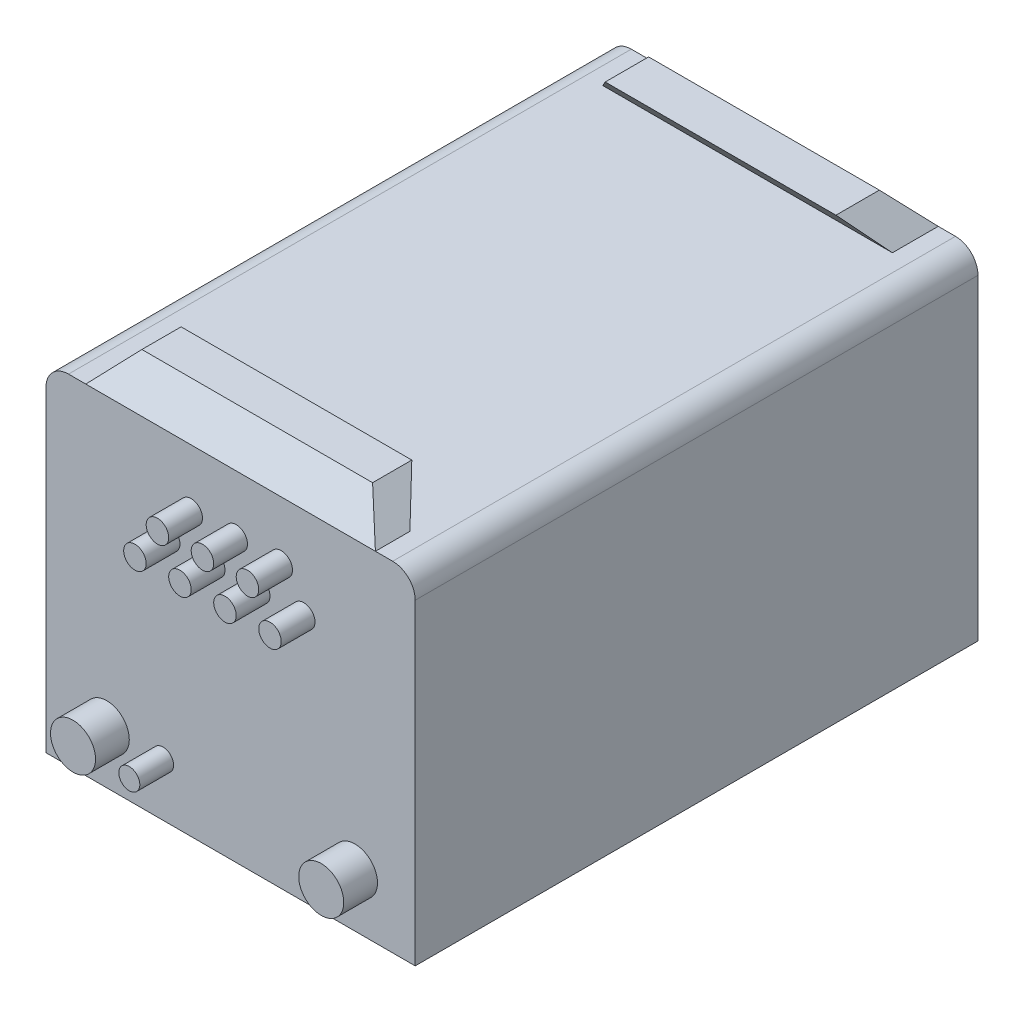
ISO-10303-21;
HEADER;
FILE_DESCRIPTION(('STEP AP214'),'2;1');
FILE_NAME('part.step','',(''),(''),'','','');
FILE_SCHEMA(('AUTOMOTIVE_DESIGN { 1 0 10303 214 1 1 1 1 }'));
ENDSEC;
DATA;
#1=APPLICATION_CONTEXT('core data for automotive mechanical design processes');
#2=APPLICATION_PROTOCOL_DEFINITION('international standard','automotive_design',2000,#1);
#3=PRODUCT_CONTEXT('',#1,'mechanical');
#4=PRODUCT('Part','Part','',(#3));
#5=PRODUCT_RELATED_PRODUCT_CATEGORY('part','',(#4));
#6=PRODUCT_DEFINITION_FORMATION('','',#4);
#7=PRODUCT_DEFINITION_CONTEXT('part definition',#1,'design');
#8=PRODUCT_DEFINITION('design','',#6,#7);
#9=PRODUCT_DEFINITION_SHAPE('','',#8);
#10=(LENGTH_UNIT() NAMED_UNIT(*) SI_UNIT(.MILLI.,.METRE.));
#11=(NAMED_UNIT(*) PLANE_ANGLE_UNIT() SI_UNIT($,.RADIAN.));
#12=(NAMED_UNIT(*) SI_UNIT($,.STERADIAN.) SOLID_ANGLE_UNIT());
#13=UNCERTAINTY_MEASURE_WITH_UNIT(LENGTH_MEASURE(1.E-05),#10,'distance_accuracy_value','');
#14=(GEOMETRIC_REPRESENTATION_CONTEXT(3) GLOBAL_UNCERTAINTY_ASSIGNED_CONTEXT((#13)) GLOBAL_UNIT_ASSIGNED_CONTEXT((#10,
#11,#12)) REPRESENTATION_CONTEXT('',''));
#15=CARTESIAN_POINT('',(0.,0.,0.));
#16=DIRECTION('',(0.,0.,1.));
#17=DIRECTION('',(1.,0.,0.));
#18=AXIS2_PLACEMENT_3D('',#15,#16,#17);
#19=CARTESIAN_POINT('',(128.648418925013,301.34644236371,500.));
#20=DIRECTION('',(-0.728848072093987,-0.684675461664049,0.));
#21=DIRECTION('',(0.684675461664049,-0.728848072093987,0.));
#22=AXIS2_PLACEMENT_3D('',#19,#20,#21);
#23=PLANE('',#22);
#24=DIRECTION('',(0.,0.,-1.));
#25=VECTOR('',#24,1.);
#26=CARTESIAN_POINT('',(128.648418925013,301.34644236371,500.));
#27=LINE('',#26,#25);
#28=CARTESIAN_POINT('',(128.648418925013,301.34644236371,40.6901929300496));
#29=VERTEX_POINT('',#28);
#30=CARTESIAN_POINT('',(128.648418925013,301.34644236371,0.));
#31=VERTEX_POINT('',#30);
#32=EDGE_CURVE('E175',#29,#31,#27,.T.);
#33=ORIENTED_EDGE('',*,*,#32,.T.);
#34=DIRECTION('',(-0.565242834216789,0.601710113843678,0.564309735220649));
#35=VECTOR('',#34,1.);
#36=CARTESIAN_POINT('',(-30.8375981311095,471.121879875066,159.2227386324));
#37=LINE('',#36,#35);
#38=CARTESIAN_POINT('',(102.483646541866,329.199264578028,26.1215797562495));
#39=VERTEX_POINT('',#38);
#40=EDGE_CURVE('E245',#31,#39,#37,.T.);
#41=ORIENTED_EDGE('',*,*,#40,.T.);
#42=DIRECTION('',(0.,0.,-1.));
#43=VECTOR('',#42,1.);
#44=CARTESIAN_POINT('',(102.483646541866,329.199264578028,500.));
#45=LINE('',#44,#43);
#46=CARTESIAN_POINT('',(102.483646541866,329.199264578028,64.6881214992163));
#47=VERTEX_POINT('',#46);
#48=EDGE_CURVE('E167',#47,#39,#45,.T.);
#49=ORIENTED_EDGE('',*,*,#48,.F.);
#50=DIRECTION('',(0.579827331426371,-0.617235546357104,-0.531808749499498));
#51=VECTOR('',#50,1.);
#52=CARTESIAN_POINT('',(-12.9830891861372,452.115467127192,170.592443369039));
#53=LINE('',#52,#51);
#54=EDGE_CURVE('E142',#47,#29,#53,.T.);
#55=ORIENTED_EDGE('',*,*,#54,.T.);
#56=EDGE_LOOP('',(#33,#41,#49,#55));
#57=FACE_BOUND('',#56,.T.);
#58=ADVANCED_FACE('F35',(#57),#23,.F.);
#59=CARTESIAN_POINT('',(102.483646541866,329.199264578028,500.));
#60=DIRECTION('',(0.,-1.,0.));
#61=DIRECTION('',(0.,0.,-1.));
#62=AXIS2_PLACEMENT_3D('',#59,#60,#61);
#63=PLANE('',#62);
#64=ORIENTED_EDGE('',*,*,#48,.T.);
#65=DIRECTION('',(-1.,0.,0.));
#66=VECTOR('',#65,1.);
#67=CARTESIAN_POINT('',(102.483646541866,329.199264578028,26.1215797562495));
#68=LINE('',#67,#66);
#69=CARTESIAN_POINT('',(-102.483646541866,329.199264578028,26.1215797562495));
#70=VERTEX_POINT('',#69);
#71=EDGE_CURVE('E251',#39,#70,#68,.T.);
#72=ORIENTED_EDGE('',*,*,#71,.T.);
#73=DIRECTION('',(0.,0.,-1.));
#74=VECTOR('',#73,1.);
#75=CARTESIAN_POINT('',(-102.483646541866,329.199264578028,500.));
#76=LINE('',#75,#74);
#77=CARTESIAN_POINT('',(-102.483646541866,329.199264578028,64.6881214992163));
#78=VERTEX_POINT('',#77);
#79=EDGE_CURVE('E163',#78,#70,#76,.T.);
#80=ORIENTED_EDGE('',*,*,#79,.F.);
#81=DIRECTION('',(1.,0.,0.));
#82=VECTOR('',#81,1.);
#83=CARTESIAN_POINT('',(102.483646541866,329.199264578028,64.6881214992163));
#84=LINE('',#83,#82);
#85=EDGE_CURVE('E232',#78,#47,#84,.T.);
#86=ORIENTED_EDGE('',*,*,#85,.T.);
#87=EDGE_LOOP('',(#64,#72,#80,#86));
#88=FACE_BOUND('',#87,.T.);
#89=ADVANCED_FACE('F240',(#88),#63,.F.);
#90=CARTESIAN_POINT('',(-128.648418925013,301.34644236371,500.));
#91=DIRECTION('',(0.728848072093986,-0.68467546166405,0.));
#92=DIRECTION('',(0.68467546166405,0.728848072093986,0.));
#93=AXIS2_PLACEMENT_3D('',#90,#91,#92);
#94=PLANE('',#93);
#95=ORIENTED_EDGE('',*,*,#79,.T.);
#96=DIRECTION('',(-0.56524283421679,-0.601710113843678,-0.564309735220649));
#97=VECTOR('',#96,1.);
#98=CARTESIAN_POINT('',(30.8375981311096,471.121879875066,159.222738632399));
#99=LINE('',#98,#97);
#100=CARTESIAN_POINT('',(-128.648418925013,301.34644236371,0.));
#101=VERTEX_POINT('',#100);
#102=EDGE_CURVE('E219',#70,#101,#99,.T.);
#103=ORIENTED_EDGE('',*,*,#102,.T.);
#104=DIRECTION('',(0.,0.,-1.));
#105=VECTOR('',#104,1.);
#106=CARTESIAN_POINT('',(-128.648418925013,301.34644236371,500.));
#107=LINE('',#106,#105);
#108=CARTESIAN_POINT('',(-128.648418925013,301.34644236371,40.6901929300496));
#109=VERTEX_POINT('',#108);
#110=EDGE_CURVE('E159',#109,#101,#107,.T.);
#111=ORIENTED_EDGE('',*,*,#110,.F.);
#112=DIRECTION('',(0.579827331426372,0.617235546357104,0.531808749499498));
#113=VECTOR('',#112,1.);
#114=CARTESIAN_POINT('',(12.9830891861374,452.115467127192,170.592443369038));
#115=LINE('',#114,#113);
#116=EDGE_CURVE('E216',#109,#78,#115,.T.);
#117=ORIENTED_EDGE('',*,*,#116,.T.);
#118=EDGE_LOOP('',(#95,#103,#111,#117));
#119=FACE_BOUND('',#118,.T.);
#120=ADVANCED_FACE('F213',(#119),#94,.F.);
#121=CARTESIAN_POINT('',(164.,0.,500.));
#122=DIRECTION('',(-1.,0.,0.));
#123=DIRECTION('',(0.,0.,1.));
#124=AXIS2_PLACEMENT_3D('',#121,#122,#123);
#125=PLANE('',#124);
#126=DIRECTION('',(0.,1.,0.));
#127=VECTOR('',#126,1.);
#128=CARTESIAN_POINT('',(164.,0.,0.));
#129=LINE('',#128,#127);
#130=CARTESIAN_POINT('',(164.,0.,0.));
#131=VERTEX_POINT('',#130);
#132=CARTESIAN_POINT('',(164.,281.346442363709,0.));
#133=VERTEX_POINT('',#132);
#134=EDGE_CURVE('E138',#131,#133,#129,.T.);
#135=ORIENTED_EDGE('',*,*,#134,.T.);
#136=DIRECTION('',(0.,0.,-1.));
#137=VECTOR('',#136,1.);
#138=CARTESIAN_POINT('',(164.,281.346442363709,500.));
#139=LINE('',#138,#137);
#140=CARTESIAN_POINT('',(164.,281.346442363709,500.));
#141=VERTEX_POINT('',#140);
#142=EDGE_CURVE('E177',#141,#133,#139,.T.);
#143=ORIENTED_EDGE('',*,*,#142,.F.);
#144=DIRECTION('',(0.,1.,0.));
#145=VECTOR('',#144,1.);
#146=CARTESIAN_POINT('',(164.,0.,500.));
#147=LINE('',#146,#145);
#148=CARTESIAN_POINT('',(164.,0.,500.));
#149=VERTEX_POINT('',#148);
#150=EDGE_CURVE('E155',#149,#141,#147,.T.);
#151=ORIENTED_EDGE('',*,*,#150,.F.);
#152=DIRECTION('',(0.,0.,-1.));
#153=VECTOR('',#152,1.);
#154=CARTESIAN_POINT('',(164.,0.,500.));
#155=LINE('',#154,#153);
#156=EDGE_CURVE('E134',#149,#131,#155,.T.);
#157=ORIENTED_EDGE('',*,*,#156,.T.);
#158=EDGE_LOOP('',(#135,#143,#151,#157));
#159=FACE_BOUND('',#158,.T.);
#160=ADVANCED_FACE('F37',(#159),#125,.F.);
#161=CARTESIAN_POINT('',(144.,281.34644236371,500.));
#162=DIRECTION('',(0.,0.,-1.));
#163=DIRECTION('',(-1.,0.,0.));
#164=AXIS2_PLACEMENT_3D('',#161,#162,#163);
#165=CYLINDRICAL_SURFACE('',#164,20.);
#166=CARTESIAN_POINT('',(144.,281.34644236371,0.));
#167=DIRECTION('',(0.,0.,1.));
#168=DIRECTION('',(1.,0.,0.));
#169=AXIS2_PLACEMENT_3D('',#166,#167,#168);
#170=CIRCLE('',#169,20.);
#171=CARTESIAN_POINT('',(144.,301.34644236371,0.));
#172=VERTEX_POINT('',#171);
#173=EDGE_CURVE('E141',#133,#172,#170,.T.);
#174=ORIENTED_EDGE('',*,*,#173,.T.);
#175=DIRECTION('',(0.,0.,-1.));
#176=VECTOR('',#175,1.);
#177=CARTESIAN_POINT('',(144.,301.34644236371,500.));
#178=LINE('',#177,#176);
#179=CARTESIAN_POINT('',(144.,301.34644236371,500.));
#180=VERTEX_POINT('',#179);
#181=EDGE_CURVE('E174',#180,#172,#178,.T.);
#182=ORIENTED_EDGE('',*,*,#181,.F.);
#183=CARTESIAN_POINT('',(144.,281.34644236371,500.));
#184=DIRECTION('',(0.,0.,1.));
#185=DIRECTION('',(1.,0.,0.));
#186=AXIS2_PLACEMENT_3D('',#183,#184,#185);
#187=CIRCLE('',#186,20.);
#188=EDGE_CURVE('E98',#141,#180,#187,.T.);
#189=ORIENTED_EDGE('',*,*,#188,.F.);
#190=ORIENTED_EDGE('',*,*,#142,.T.);
#191=EDGE_LOOP('',(#174,#182,#189,#190));
#192=FACE_BOUND('',#191,.T.);
#193=ADVANCED_FACE('F387',(#192),#165,.T.);
#194=CARTESIAN_POINT('',(102.483646541866,329.199264578028,476.336279604202));
#195=VERTEX_POINT('',#194);
#196=CARTESIAN_POINT('',(102.483646541866,329.199264578028,441.498124293038));
#197=VERTEX_POINT('',#196);
#198=EDGE_CURVE('E170',#195,#197,#45,.T.);
#199=ORIENTED_EDGE('',*,*,#198,.F.);
#200=DIRECTION('',(0.582108594746169,-0.619663987955599,0.526465693045239));
#201=VECTOR('',#200,1.);
#202=CARTESIAN_POINT('',(128.648418925013,301.34644236371,500.));
#203=LINE('',#202,#201);
#204=CARTESIAN_POINT('',(128.648418925013,301.34644236371,500.));
#205=VERTEX_POINT('',#204);
#206=EDGE_CURVE('E261',#195,#205,#203,.T.);
#207=ORIENTED_EDGE('',*,*,#206,.T.);
#208=CARTESIAN_POINT('',(128.648418925013,301.34644236371,469.350946507356));
#209=VERTEX_POINT('',#208);
#210=EDGE_CURVE('E171',#205,#209,#27,.T.);
#211=ORIENTED_EDGE('',*,*,#210,.T.);
#212=DIRECTION('',(-0.553306836142434,0.58900405137743,-0.589004051377428));
#213=VECTOR('',#212,1.);
#214=CARTESIAN_POINT('',(138.636944481871,290.713495803184,479.983893067882));
#215=LINE('',#214,#213);
#216=EDGE_CURVE('E269',#209,#197,#215,.T.);
#217=ORIENTED_EDGE('',*,*,#216,.T.);
#218=EDGE_LOOP('',(#199,#207,#211,#217));
#219=FACE_BOUND('',#218,.T.);
#220=ADVANCED_FACE('F285',(#219),#23,.F.);
#221=CARTESIAN_POINT('',(-102.483646541866,329.199264578028,476.336279604202));
#222=VERTEX_POINT('',#221);
#223=CARTESIAN_POINT('',(-102.483646541866,329.199264578028,441.498124293038));
#224=VERTEX_POINT('',#223);
#225=EDGE_CURVE('E166',#222,#224,#76,.T.);
#226=ORIENTED_EDGE('',*,*,#225,.F.);
#227=DIRECTION('',(1.,0.,0.));
#228=VECTOR('',#227,1.);
#229=CARTESIAN_POINT('',(102.483646541866,329.199264578028,476.336279604202));
#230=LINE('',#229,#228);
#231=EDGE_CURVE('E254',#222,#195,#230,.T.);
#232=ORIENTED_EDGE('',*,*,#231,.T.);
#233=ORIENTED_EDGE('',*,*,#198,.T.);
#234=DIRECTION('',(-1.,0.,0.));
#235=VECTOR('',#234,1.);
#236=CARTESIAN_POINT('',(102.483646541866,329.199264578028,441.498124293038));
#237=LINE('',#236,#235);
#238=EDGE_CURVE('E266',#197,#224,#237,.T.);
#239=ORIENTED_EDGE('',*,*,#238,.T.);
#240=EDGE_LOOP('',(#226,#232,#233,#239));
#241=FACE_BOUND('',#240,.T.);
#242=ADVANCED_FACE('F385',(#241),#63,.F.);
#243=CARTESIAN_POINT('',(-128.648418925013,301.34644236371,500.));
#244=VERTEX_POINT('',#243);
#245=CARTESIAN_POINT('',(-128.648418925013,301.34644236371,469.350946507356));
#246=VERTEX_POINT('',#245);
#247=EDGE_CURVE('E160',#244,#246,#107,.T.);
#248=ORIENTED_EDGE('',*,*,#247,.F.);
#249=DIRECTION('',(0.58210859474617,0.619663987955598,-0.526465693045239));
#250=VECTOR('',#249,1.);
#251=CARTESIAN_POINT('',(-128.648418925013,301.34644236371,500.));
#252=LINE('',#251,#250);
#253=EDGE_CURVE('E250',#244,#222,#252,.T.);
#254=ORIENTED_EDGE('',*,*,#253,.T.);
#255=ORIENTED_EDGE('',*,*,#225,.T.);
#256=DIRECTION('',(-0.553306836142435,-0.589004051377429,0.589004051377427));
#257=VECTOR('',#256,1.);
#258=CARTESIAN_POINT('',(-138.636944481871,290.713495803184,479.983893067882));
#259=LINE('',#258,#257);
#260=EDGE_CURVE('E264',#224,#246,#259,.T.);
#261=ORIENTED_EDGE('',*,*,#260,.T.);
#262=EDGE_LOOP('',(#248,#254,#255,#261));
#263=FACE_BOUND('',#262,.T.);
#264=ADVANCED_FACE('F392',(#263),#94,.F.);
#265=CARTESIAN_POINT('',(-144.,301.34644236371,500.));
#266=DIRECTION('',(0.,-1.,0.));
#267=DIRECTION('',(0.,0.,-1.));
#268=AXIS2_PLACEMENT_3D('',#265,#266,#267);
#269=PLANE('',#268);
#270=ORIENTED_EDGE('',*,*,#247,.T.);
#271=DIRECTION('',(1.,0.,0.));
#272=VECTOR('',#271,1.);
#273=CARTESIAN_POINT('',(-165.,301.34644236371,469.350946507356));
#274=LINE('',#273,#272);
#275=EDGE_CURVE('E50',#246,#209,#274,.T.);
#276=ORIENTED_EDGE('',*,*,#275,.T.);
#277=ORIENTED_EDGE('',*,*,#210,.F.);
#278=DIRECTION('',(-1.,0.,0.));
#279=VECTOR('',#278,1.);
#280=CARTESIAN_POINT('',(144.,301.34644236371,500.));
#281=LINE('',#280,#279);
#282=EDGE_CURVE('E275',#180,#205,#281,.T.);
#283=ORIENTED_EDGE('',*,*,#282,.F.);
#284=ORIENTED_EDGE('',*,*,#181,.T.);
#285=DIRECTION('',(-1.,0.,0.));
#286=VECTOR('',#285,1.);
#287=CARTESIAN_POINT('',(144.,301.34644236371,0.));
#288=LINE('',#287,#286);
#289=EDGE_CURVE('E145',#172,#31,#288,.T.);
#290=ORIENTED_EDGE('',*,*,#289,.T.);
#291=ORIENTED_EDGE('',*,*,#32,.F.);
#292=DIRECTION('',(1.,0.,0.));
#293=VECTOR('',#292,1.);
#294=CARTESIAN_POINT('',(-165.,301.34644236371,40.6901929300496));
#295=LINE('',#294,#293);
#296=EDGE_CURVE('E209',#109,#29,#295,.T.);
#297=ORIENTED_EDGE('',*,*,#296,.F.);
#298=ORIENTED_EDGE('',*,*,#110,.T.);
#299=DIRECTION('',(-1.,0.,0.));
#300=VECTOR('',#299,1.);
#301=CARTESIAN_POINT('',(-144.,301.34644236371,0.));
#302=LINE('',#301,#300);
#303=CARTESIAN_POINT('',(-144.,301.34644236371,0.));
#304=VERTEX_POINT('',#303);
#305=EDGE_CURVE('E148',#101,#304,#302,.T.);
#306=ORIENTED_EDGE('',*,*,#305,.T.);
#307=DIRECTION('',(0.,0.,-1.));
#308=VECTOR('',#307,1.);
#309=CARTESIAN_POINT('',(-144.,301.34644236371,500.));
#310=LINE('',#309,#308);
#311=CARTESIAN_POINT('',(-144.,301.34644236371,500.));
#312=VERTEX_POINT('',#311);
#313=EDGE_CURVE('E129',#312,#304,#310,.T.);
#314=ORIENTED_EDGE('',*,*,#313,.F.);
#315=DIRECTION('',(-1.,0.,0.));
#316=VECTOR('',#315,1.);
#317=CARTESIAN_POINT('',(-144.,301.34644236371,500.));
#318=LINE('',#317,#316);
#319=EDGE_CURVE('E118',#244,#312,#318,.T.);
#320=ORIENTED_EDGE('',*,*,#319,.F.);
#321=EDGE_LOOP('',(#270,#276,#277,#283,#284,#290,#291,#297,#298,#306,#314,#320));
#322=FACE_BOUND('',#321,.T.);
#323=ADVANCED_FACE('F203',(#322),#269,.F.);
#324=CARTESIAN_POINT('',(-144.,281.34644236371,500.));
#325=DIRECTION('',(0.,0.,-1.));
#326=DIRECTION('',(-1.,0.,0.));
#327=AXIS2_PLACEMENT_3D('',#324,#325,#326);
#328=CYLINDRICAL_SURFACE('',#327,20.);
#329=CARTESIAN_POINT('',(-144.,281.34644236371,0.));
#330=DIRECTION('',(0.,0.,1.));
#331=DIRECTION('',(1.,0.,0.));
#332=AXIS2_PLACEMENT_3D('',#329,#330,#331);
#333=CIRCLE('',#332,20.);
#334=CARTESIAN_POINT('',(-164.,281.346442363709,0.));
#335=VERTEX_POINT('',#334);
#336=EDGE_CURVE('E126',#304,#335,#333,.T.);
#337=ORIENTED_EDGE('',*,*,#336,.T.);
#338=DIRECTION('',(0.,0.,-1.));
#339=VECTOR('',#338,1.);
#340=CARTESIAN_POINT('',(-164.,281.346442363709,500.));
#341=LINE('',#340,#339);
#342=CARTESIAN_POINT('',(-164.,281.346442363709,500.));
#343=VERTEX_POINT('',#342);
#344=EDGE_CURVE('E123',#343,#335,#341,.T.);
#345=ORIENTED_EDGE('',*,*,#344,.F.);
#346=CARTESIAN_POINT('',(-144.,281.34644236371,500.));
#347=DIRECTION('',(0.,0.,1.));
#348=DIRECTION('',(1.,0.,0.));
#349=AXIS2_PLACEMENT_3D('',#346,#347,#348);
#350=CIRCLE('',#349,20.);
#351=EDGE_CURVE('E110',#312,#343,#350,.T.);
#352=ORIENTED_EDGE('',*,*,#351,.F.);
#353=ORIENTED_EDGE('',*,*,#313,.T.);
#354=EDGE_LOOP('',(#337,#345,#352,#353));
#355=FACE_BOUND('',#354,.T.);
#356=ADVANCED_FACE('F124',(#355),#328,.T.);
#357=CARTESIAN_POINT('',(-164.,2.22044604925031E-13,500.));
#358=DIRECTION('',(1.,0.,0.));
#359=DIRECTION('',(0.,0.,-1.));
#360=AXIS2_PLACEMENT_3D('',#357,#358,#359);
#361=PLANE('',#360);
#362=DIRECTION('',(0.,-1.,0.));
#363=VECTOR('',#362,1.);
#364=CARTESIAN_POINT('',(-164.,2.22044604925031E-13,0.));
#365=LINE('',#364,#363);
#366=CARTESIAN_POINT('',(-164.,2.22044604925031E-13,0.));
#367=VERTEX_POINT('',#366);
#368=EDGE_CURVE('E152',#335,#367,#365,.T.);
#369=ORIENTED_EDGE('',*,*,#368,.T.);
#370=DIRECTION('',(0.,0.,-1.));
#371=VECTOR('',#370,1.);
#372=CARTESIAN_POINT('',(-164.,2.22044604925031E-13,500.));
#373=LINE('',#372,#371);
#374=CARTESIAN_POINT('',(-164.,2.22044604925031E-13,500.));
#375=VERTEX_POINT('',#374);
#376=EDGE_CURVE('E130',#375,#367,#373,.T.);
#377=ORIENTED_EDGE('',*,*,#376,.F.);
#378=DIRECTION('',(0.,-1.,0.));
#379=VECTOR('',#378,1.);
#380=CARTESIAN_POINT('',(-164.,2.22044604925031E-13,500.));
#381=LINE('',#380,#379);
#382=EDGE_CURVE('E115',#343,#375,#381,.T.);
#383=ORIENTED_EDGE('',*,*,#382,.F.);
#384=ORIENTED_EDGE('',*,*,#344,.T.);
#385=EDGE_LOOP('',(#369,#377,#383,#384));
#386=FACE_BOUND('',#385,.T.);
#387=ADVANCED_FACE('F132',(#386),#361,.F.);
#388=CARTESIAN_POINT('',(-164.,2.22044604925031E-13,500.));
#389=DIRECTION('',(0.,1.,0.));
#390=DIRECTION('',(-1.,0.,0.));
#391=AXIS2_PLACEMENT_3D('',#388,#389,#390);
#392=PLANE('',#391);
#393=DIRECTION('',(1.,0.,0.));
#394=VECTOR('',#393,1.);
#395=CARTESIAN_POINT('',(-164.,2.22044604925031E-13,0.));
#396=LINE('',#395,#394);
#397=EDGE_CURVE('E89',#367,#131,#396,.T.);
#398=ORIENTED_EDGE('',*,*,#397,.T.);
#399=ORIENTED_EDGE('',*,*,#156,.F.);
#400=DIRECTION('',(1.,0.,0.));
#401=VECTOR('',#400,1.);
#402=CARTESIAN_POINT('',(-164.,2.22044604925031E-13,500.));
#403=LINE('',#402,#401);
#404=EDGE_CURVE('E59',#375,#149,#403,.T.);
#405=ORIENTED_EDGE('',*,*,#404,.F.);
#406=ORIENTED_EDGE('',*,*,#376,.T.);
#407=EDGE_LOOP('',(#398,#399,#405,#406));
#408=FACE_BOUND('',#407,.T.);
#409=ADVANCED_FACE('F420',(#408),#392,.F.);
#410=CARTESIAN_POINT('',(144.,281.34644236371,500.));
#411=DIRECTION('',(0.,0.,1.));
#412=DIRECTION('',(1.,0.,0.));
#413=AXIS2_PLACEMENT_3D('',#410,#411,#412);
#414=PLANE('',#413);
#415=CARTESIAN_POINT('',(45.,250.,500.));
#416=DIRECTION('',(0.,0.,1.));
#417=DIRECTION('',(1.,0.,0.));
#418=AXIS2_PLACEMENT_3D('',#415,#416,#417);
#419=CIRCLE('',#418,10.);
#420=CARTESIAN_POINT('',(55.,250.,500.));
#421=VERTEX_POINT('',#420);
#422=EDGE_CURVE('E352',#421,#421,#419,.T.);
#423=ORIENTED_EDGE('',*,*,#422,.F.);
#424=EDGE_LOOP('',(#423));
#425=FACE_BOUND('',#424,.T.);
#426=CARTESIAN_POINT('',(5.,250.,500.));
#427=DIRECTION('',(0.,0.,1.));
#428=DIRECTION('',(1.,0.,0.));
#429=AXIS2_PLACEMENT_3D('',#426,#427,#428);
#430=CIRCLE('',#429,10.);
#431=CARTESIAN_POINT('',(15.,250.,500.));
#432=VERTEX_POINT('',#431);
#433=EDGE_CURVE('E346',#432,#432,#430,.T.);
#434=ORIENTED_EDGE('',*,*,#433,.F.);
#435=EDGE_LOOP('',(#434));
#436=FACE_BOUND('',#435,.T.);
#437=CARTESIAN_POINT('',(65.,220.,500.));
#438=DIRECTION('',(0.,0.,1.));
#439=DIRECTION('',(1.,0.,0.));
#440=AXIS2_PLACEMENT_3D('',#437,#438,#439);
#441=CIRCLE('',#440,10.);
#442=CARTESIAN_POINT('',(75.,220.,500.));
#443=VERTEX_POINT('',#442);
#444=EDGE_CURVE('E340',#443,#443,#441,.T.);
#445=ORIENTED_EDGE('',*,*,#444,.F.);
#446=EDGE_LOOP('',(#445));
#447=FACE_BOUND('',#446,.T.);
#448=CARTESIAN_POINT('',(25.,220.,500.));
#449=DIRECTION('',(0.,0.,1.));
#450=DIRECTION('',(1.,0.,0.));
#451=AXIS2_PLACEMENT_3D('',#448,#449,#450);
#452=CIRCLE('',#451,10.);
#453=CARTESIAN_POINT('',(35.,220.,500.));
#454=VERTEX_POINT('',#453);
#455=EDGE_CURVE('E334',#454,#454,#452,.T.);
#456=ORIENTED_EDGE('',*,*,#455,.F.);
#457=EDGE_LOOP('',(#456));
#458=FACE_BOUND('',#457,.T.);
#459=CARTESIAN_POINT('',(-15.,220.,500.));
#460=DIRECTION('',(0.,0.,1.));
#461=DIRECTION('',(1.,0.,0.));
#462=AXIS2_PLACEMENT_3D('',#459,#460,#461);
#463=CIRCLE('',#462,10.);
#464=CARTESIAN_POINT('',(-4.99999999999999,220.,500.));
#465=VERTEX_POINT('',#464);
#466=EDGE_CURVE('E328',#465,#465,#463,.T.);
#467=ORIENTED_EDGE('',*,*,#466,.F.);
#468=EDGE_LOOP('',(#467));
#469=FACE_BOUND('',#468,.T.);
#470=CARTESIAN_POINT('',(-35.,250.,500.));
#471=DIRECTION('',(0.,0.,1.));
#472=DIRECTION('',(1.,0.,0.));
#473=AXIS2_PLACEMENT_3D('',#470,#471,#472);
#474=CIRCLE('',#473,10.);
#475=CARTESIAN_POINT('',(-25.,250.,500.));
#476=VERTEX_POINT('',#475);
#477=EDGE_CURVE('E322',#476,#476,#474,.T.);
#478=ORIENTED_EDGE('',*,*,#477,.F.);
#479=EDGE_LOOP('',(#478));
#480=FACE_BOUND('',#479,.T.);
#481=CARTESIAN_POINT('',(-55.,220.,500.));
#482=DIRECTION('',(0.,0.,1.));
#483=DIRECTION('',(1.,0.,0.));
#484=AXIS2_PLACEMENT_3D('',#481,#482,#483);
#485=CIRCLE('',#484,10.);
#486=CARTESIAN_POINT('',(-45.,220.,500.));
#487=VERTEX_POINT('',#486);
#488=EDGE_CURVE('E316',#487,#487,#485,.T.);
#489=ORIENTED_EDGE('',*,*,#488,.F.);
#490=EDGE_LOOP('',(#489));
#491=FACE_BOUND('',#490,.T.);
#492=CARTESIAN_POINT('',(110.509329496981,47.0693136460908,500.));
#493=DIRECTION('',(0.,0.,1.));
#494=DIRECTION('',(1.,0.,0.));
#495=AXIS2_PLACEMENT_3D('',#492,#493,#494);
#496=CIRCLE('',#495,19.9999999999999);
#497=CARTESIAN_POINT('',(130.509329496981,47.0693136460908,500.));
#498=VERTEX_POINT('',#497);
#499=EDGE_CURVE('E310',#498,#498,#496,.T.);
#500=ORIENTED_EDGE('',*,*,#499,.F.);
#501=EDGE_LOOP('',(#500));
#502=FACE_BOUND('',#501,.T.);
#503=CARTESIAN_POINT('',(-60.,47.0693136460908,500.));
#504=DIRECTION('',(0.,0.,1.));
#505=DIRECTION('',(1.,0.,0.));
#506=AXIS2_PLACEMENT_3D('',#503,#504,#505);
#507=CIRCLE('',#506,9.34104242685201);
#508=CARTESIAN_POINT('',(-50.658957573148,47.0693136460908,500.));
#509=VERTEX_POINT('',#508);
#510=EDGE_CURVE('E304',#509,#509,#507,.T.);
#511=ORIENTED_EDGE('',*,*,#510,.F.);
#512=EDGE_LOOP('',(#511));
#513=FACE_BOUND('',#512,.T.);
#514=CARTESIAN_POINT('',(-110.,47.0693136460908,500.));
#515=DIRECTION('',(0.,0.,1.));
#516=DIRECTION('',(1.,0.,0.));
#517=AXIS2_PLACEMENT_3D('',#514,#515,#516);
#518=CIRCLE('',#517,20.);
#519=CARTESIAN_POINT('',(-90.,47.0693136460908,500.));
#520=VERTEX_POINT('',#519);
#521=EDGE_CURVE('E298',#520,#520,#518,.T.);
#522=ORIENTED_EDGE('',*,*,#521,.F.);
#523=EDGE_LOOP('',(#522));
#524=FACE_BOUND('',#523,.T.);
#525=DIRECTION('',(1.,0.,0.));
#526=VECTOR('',#525,1.);
#527=CARTESIAN_POINT('',(144.,301.34644236371,500.));
#528=LINE('',#527,#526);
#529=EDGE_CURVE('E182',#244,#205,#528,.T.);
#530=ORIENTED_EDGE('',*,*,#529,.F.);
#531=ORIENTED_EDGE('',*,*,#319,.T.);
#532=ORIENTED_EDGE('',*,*,#351,.T.);
#533=ORIENTED_EDGE('',*,*,#382,.T.);
#534=ORIENTED_EDGE('',*,*,#404,.T.);
#535=ORIENTED_EDGE('',*,*,#150,.T.);
#536=ORIENTED_EDGE('',*,*,#188,.T.);
#537=ORIENTED_EDGE('',*,*,#282,.T.);
#538=EDGE_LOOP('',(#530,#531,#532,#533,#534,#535,#536,#537));
#539=FACE_BOUND('',#538,.T.);
#540=ADVANCED_FACE('F113',(#425,#436,#447,#458,#469,#480,#491,#502,#513,#524,#539),#414,.T.);
#541=CARTESIAN_POINT('',(144.,281.34644236371,0.));
#542=DIRECTION('',(0.,0.,1.));
#543=DIRECTION('',(1.,0.,0.));
#544=AXIS2_PLACEMENT_3D('',#541,#542,#543);
#545=PLANE('',#544);
#546=CARTESIAN_POINT('',(73.8134337645285,29.9340522364681,0.));
#547=DIRECTION('',(0.,0.,1.));
#548=DIRECTION('',(1.,0.,0.));
#549=AXIS2_PLACEMENT_3D('',#546,#547,#548);
#550=CIRCLE('',#549,9.22667922056602);
#551=CARTESIAN_POINT('',(83.0401129850945,29.9340522364681,0.));
#552=VERTEX_POINT('',#551);
#553=EDGE_CURVE('E11',#552,#552,#550,.F.);
#554=ORIENTED_EDGE('',*,*,#553,.F.);
#555=EDGE_LOOP('',(#554));
#556=FACE_BOUND('',#555,.T.);
#557=CARTESIAN_POINT('',(12.3022389607548,29.9340522364681,0.));
#558=DIRECTION('',(0.,0.,1.));
#559=DIRECTION('',(1.,0.,0.));
#560=AXIS2_PLACEMENT_3D('',#557,#558,#559);
#561=CIRCLE('',#560,8.25493161637547);
#562=CARTESIAN_POINT('',(20.5571705771302,29.9340522364681,0.));
#563=VERTEX_POINT('',#562);
#564=EDGE_CURVE('E43',#563,#563,#561,.F.);
#565=ORIENTED_EDGE('',*,*,#564,.F.);
#566=EDGE_LOOP('',(#565));
#567=FACE_BOUND('',#566,.T.);
#568=ORIENTED_EDGE('',*,*,#305,.F.);
#569=DIRECTION('',(1.,0.,0.));
#570=VECTOR('',#569,1.);
#571=CARTESIAN_POINT('',(144.,301.34644236371,0.));
#572=LINE('',#571,#570);
#573=EDGE_CURVE('E179',#101,#31,#572,.T.);
#574=ORIENTED_EDGE('',*,*,#573,.T.);
#575=ORIENTED_EDGE('',*,*,#289,.F.);
#576=ORIENTED_EDGE('',*,*,#173,.F.);
#577=ORIENTED_EDGE('',*,*,#134,.F.);
#578=ORIENTED_EDGE('',*,*,#397,.F.);
#579=ORIENTED_EDGE('',*,*,#368,.F.);
#580=ORIENTED_EDGE('',*,*,#336,.F.);
#581=EDGE_LOOP('',(#568,#574,#575,#576,#577,#578,#579,#580));
#582=FACE_BOUND('',#581,.T.);
#583=ADVANCED_FACE('F189',(#556,#567,#582),#545,.F.);
#584=CARTESIAN_POINT('',(-165.,344.733431976228,40.6901929300496));
#585=DIRECTION('',(0.,-0.684074349324247,0.729412287116558));
#586=DIRECTION('',(0.,-0.729412287116558,-0.684074349324247));
#587=AXIS2_PLACEMENT_3D('',#584,#585,#586);
#588=PLANE('',#587);
#589=ORIENTED_EDGE('',*,*,#573,.F.);
#590=ORIENTED_EDGE('',*,*,#102,.F.);
#591=ORIENTED_EDGE('',*,*,#71,.F.);
#592=ORIENTED_EDGE('',*,*,#40,.F.);
#593=EDGE_LOOP('',(#589,#590,#591,#592));
#594=FACE_BOUND('',#593,.T.);
#595=ADVANCED_FACE('F192',(#594),#588,.F.);
#596=CARTESIAN_POINT('',(-165.,344.733431976228,463.13847181783));
#597=DIRECTION('',(0.,-0.647470836040153,-0.762090228567107));
#598=DIRECTION('',(0.,0.762090228567107,-0.647470836040153));
#599=AXIS2_PLACEMENT_3D('',#596,#597,#598);
#600=PLANE('',#599);
#601=ORIENTED_EDGE('',*,*,#231,.F.);
#602=ORIENTED_EDGE('',*,*,#253,.F.);
#603=ORIENTED_EDGE('',*,*,#529,.T.);
#604=ORIENTED_EDGE('',*,*,#206,.F.);
#605=EDGE_LOOP('',(#601,#602,#603,#604));
#606=FACE_BOUND('',#605,.T.);
#607=ADVANCED_FACE('F403',(#606),#600,.F.);
#608=CARTESIAN_POINT('',(-165.,339.458620278002,73.5275591461166));
#609=DIRECTION('',(0.,0.652734799846493,-0.757586484217716));
#610=DIRECTION('',(0.,0.757586484217716,0.652734799846493));
#611=AXIS2_PLACEMENT_3D('',#608,#609,#610);
#612=PLANE('',#611);
#613=ORIENTED_EDGE('',*,*,#85,.F.);
#614=ORIENTED_EDGE('',*,*,#116,.F.);
#615=ORIENTED_EDGE('',*,*,#296,.T.);
#616=ORIENTED_EDGE('',*,*,#54,.F.);
#617=EDGE_LOOP('',(#613,#614,#615,#616));
#618=FACE_BOUND('',#617,.T.);
#619=ADVANCED_FACE('F234',(#618),#612,.F.);
#620=CARTESIAN_POINT('',(-165.,301.34644236371,469.350946507356));
#621=DIRECTION('',(0.,0.707106781186547,0.707106781186549));
#622=DIRECTION('',(0.,-0.707106781186549,0.707106781186547));
#623=AXIS2_PLACEMENT_3D('',#620,#621,#622);
#624=PLANE('',#623);
#625=ORIENTED_EDGE('',*,*,#275,.F.);
#626=ORIENTED_EDGE('',*,*,#260,.F.);
#627=ORIENTED_EDGE('',*,*,#238,.F.);
#628=ORIENTED_EDGE('',*,*,#216,.F.);
#629=EDGE_LOOP('',(#625,#626,#627,#628));
#630=FACE_BOUND('',#629,.T.);
#631=ADVANCED_FACE('F405',(#630),#624,.F.);
#632=CARTESIAN_POINT('',(-110.,47.0693136460908,530.));
#633=DIRECTION('',(0.,0.,-1.));
#634=DIRECTION('',(-1.,0.,0.));
#635=AXIS2_PLACEMENT_3D('',#632,#633,#634);
#636=CYLINDRICAL_SURFACE('',#635,20.);
#637=CARTESIAN_POINT('',(-110.,47.0693136460908,530.));
#638=DIRECTION('',(0.,0.,1.));
#639=DIRECTION('',(1.,0.,0.));
#640=AXIS2_PLACEMENT_3D('',#637,#638,#639);
#641=CIRCLE('',#640,20.);
#642=CARTESIAN_POINT('',(-90.,47.0693136460908,530.));
#643=VERTEX_POINT('',#642);
#644=EDGE_CURVE('E296',#643,#643,#641,.T.);
#645=ORIENTED_EDGE('',*,*,#644,.F.);
#646=EDGE_LOOP('',(#645));
#647=FACE_BOUND('',#646,.T.);
#648=ORIENTED_EDGE('',*,*,#521,.T.);
#649=EDGE_LOOP('',(#648));
#650=FACE_BOUND('',#649,.T.);
#651=ADVANCED_FACE('F407',(#647,#650),#636,.T.);
#652=CARTESIAN_POINT('',(-110.,47.0693136460908,530.));
#653=DIRECTION('',(0.,0.,1.));
#654=DIRECTION('',(1.,0.,0.));
#655=AXIS2_PLACEMENT_3D('',#652,#653,#654);
#656=PLANE('',#655);
#657=ORIENTED_EDGE('',*,*,#644,.T.);
#658=EDGE_LOOP('',(#657));
#659=FACE_BOUND('',#658,.T.);
#660=ADVANCED_FACE('F413',(#659),#656,.T.);
#661=CARTESIAN_POINT('',(-60.,47.0693136460908,530.));
#662=DIRECTION('',(0.,0.,-1.));
#663=DIRECTION('',(-1.,0.,0.));
#664=AXIS2_PLACEMENT_3D('',#661,#662,#663);
#665=CYLINDRICAL_SURFACE('',#664,9.34104242685201);
#666=CARTESIAN_POINT('',(-60.,47.0693136460908,530.));
#667=DIRECTION('',(0.,0.,1.));
#668=DIRECTION('',(1.,0.,0.));
#669=AXIS2_PLACEMENT_3D('',#666,#667,#668);
#670=CIRCLE('',#669,9.34104242685201);
#671=CARTESIAN_POINT('',(-50.658957573148,47.0693136460908,530.));
#672=VERTEX_POINT('',#671);
#673=EDGE_CURVE('E301',#672,#672,#670,.T.);
#674=ORIENTED_EDGE('',*,*,#673,.F.);
#675=EDGE_LOOP('',(#674));
#676=FACE_BOUND('',#675,.T.);
#677=ORIENTED_EDGE('',*,*,#510,.T.);
#678=EDGE_LOOP('',(#677));
#679=FACE_BOUND('',#678,.T.);
#680=ADVANCED_FACE('F498',(#676,#679),#665,.T.);
#681=CARTESIAN_POINT('',(-60.,47.0693136460908,530.));
#682=DIRECTION('',(0.,0.,1.));
#683=DIRECTION('',(1.,0.,0.));
#684=AXIS2_PLACEMENT_3D('',#681,#682,#683);
#685=PLANE('',#684);
#686=ORIENTED_EDGE('',*,*,#673,.T.);
#687=EDGE_LOOP('',(#686));
#688=FACE_BOUND('',#687,.T.);
#689=ADVANCED_FACE('F508',(#688),#685,.T.);
#690=CARTESIAN_POINT('',(110.509329496981,47.0693136460908,530.));
#691=DIRECTION('',(0.,0.,-1.));
#692=DIRECTION('',(-1.,0.,0.));
#693=AXIS2_PLACEMENT_3D('',#690,#691,#692);
#694=CYLINDRICAL_SURFACE('',#693,19.9999999999999);
#695=CARTESIAN_POINT('',(110.509329496981,47.0693136460908,530.));
#696=DIRECTION('',(0.,0.,1.));
#697=DIRECTION('',(1.,0.,0.));
#698=AXIS2_PLACEMENT_3D('',#695,#696,#697);
#699=CIRCLE('',#698,19.9999999999999);
#700=CARTESIAN_POINT('',(130.509329496981,47.0693136460908,530.));
#701=VERTEX_POINT('',#700);
#702=EDGE_CURVE('E307',#701,#701,#699,.T.);
#703=ORIENTED_EDGE('',*,*,#702,.F.);
#704=EDGE_LOOP('',(#703));
#705=FACE_BOUND('',#704,.T.);
#706=ORIENTED_EDGE('',*,*,#499,.T.);
#707=EDGE_LOOP('',(#706));
#708=FACE_BOUND('',#707,.T.);
#709=ADVANCED_FACE('F518',(#705,#708),#694,.T.);
#710=CARTESIAN_POINT('',(110.509329496981,47.0693136460908,530.));
#711=DIRECTION('',(0.,0.,1.));
#712=DIRECTION('',(1.,0.,0.));
#713=AXIS2_PLACEMENT_3D('',#710,#711,#712);
#714=PLANE('',#713);
#715=ORIENTED_EDGE('',*,*,#702,.T.);
#716=EDGE_LOOP('',(#715));
#717=FACE_BOUND('',#716,.T.);
#718=ADVANCED_FACE('F528',(#717),#714,.T.);
#719=CARTESIAN_POINT('',(-55.,220.,530.));
#720=DIRECTION('',(0.,0.,-1.));
#721=DIRECTION('',(-1.,0.,0.));
#722=AXIS2_PLACEMENT_3D('',#719,#720,#721);
#723=CYLINDRICAL_SURFACE('',#722,10.);
#724=CARTESIAN_POINT('',(-55.,220.,530.));
#725=DIRECTION('',(0.,0.,1.));
#726=DIRECTION('',(1.,0.,0.));
#727=AXIS2_PLACEMENT_3D('',#724,#725,#726);
#728=CIRCLE('',#727,10.);
#729=CARTESIAN_POINT('',(-45.,220.,530.));
#730=VERTEX_POINT('',#729);
#731=EDGE_CURVE('E313',#730,#730,#728,.T.);
#732=ORIENTED_EDGE('',*,*,#731,.F.);
#733=EDGE_LOOP('',(#732));
#734=FACE_BOUND('',#733,.T.);
#735=ORIENTED_EDGE('',*,*,#488,.T.);
#736=EDGE_LOOP('',(#735));
#737=FACE_BOUND('',#736,.T.);
#738=ADVANCED_FACE('F538',(#734,#737),#723,.T.);
#739=CARTESIAN_POINT('',(-55.,220.,530.));
#740=DIRECTION('',(0.,0.,1.));
#741=DIRECTION('',(1.,0.,0.));
#742=AXIS2_PLACEMENT_3D('',#739,#740,#741);
#743=PLANE('',#742);
#744=ORIENTED_EDGE('',*,*,#731,.T.);
#745=EDGE_LOOP('',(#744));
#746=FACE_BOUND('',#745,.T.);
#747=ADVANCED_FACE('F548',(#746),#743,.T.);
#748=CARTESIAN_POINT('',(-35.,250.,530.));
#749=DIRECTION('',(0.,0.,-1.));
#750=DIRECTION('',(-1.,0.,0.));
#751=AXIS2_PLACEMENT_3D('',#748,#749,#750);
#752=CYLINDRICAL_SURFACE('',#751,10.);
#753=CARTESIAN_POINT('',(-35.,250.,530.));
#754=DIRECTION('',(0.,0.,1.));
#755=DIRECTION('',(1.,0.,0.));
#756=AXIS2_PLACEMENT_3D('',#753,#754,#755);
#757=CIRCLE('',#756,10.);
#758=CARTESIAN_POINT('',(-25.,250.,530.));
#759=VERTEX_POINT('',#758);
#760=EDGE_CURVE('E319',#759,#759,#757,.T.);
#761=ORIENTED_EDGE('',*,*,#760,.F.);
#762=EDGE_LOOP('',(#761));
#763=FACE_BOUND('',#762,.T.);
#764=ORIENTED_EDGE('',*,*,#477,.T.);
#765=EDGE_LOOP('',(#764));
#766=FACE_BOUND('',#765,.T.);
#767=ADVANCED_FACE('F558',(#763,#766),#752,.T.);
#768=CARTESIAN_POINT('',(-35.,250.,530.));
#769=DIRECTION('',(0.,0.,1.));
#770=DIRECTION('',(1.,0.,0.));
#771=AXIS2_PLACEMENT_3D('',#768,#769,#770);
#772=PLANE('',#771);
#773=ORIENTED_EDGE('',*,*,#760,.T.);
#774=EDGE_LOOP('',(#773));
#775=FACE_BOUND('',#774,.T.);
#776=ADVANCED_FACE('F568',(#775),#772,.T.);
#777=CARTESIAN_POINT('',(-15.,220.,530.));
#778=DIRECTION('',(0.,0.,-1.));
#779=DIRECTION('',(-1.,0.,0.));
#780=AXIS2_PLACEMENT_3D('',#777,#778,#779);
#781=CYLINDRICAL_SURFACE('',#780,10.);
#782=CARTESIAN_POINT('',(-15.,220.,530.));
#783=DIRECTION('',(0.,0.,1.));
#784=DIRECTION('',(1.,0.,0.));
#785=AXIS2_PLACEMENT_3D('',#782,#783,#784);
#786=CIRCLE('',#785,10.);
#787=CARTESIAN_POINT('',(-4.99999999999999,220.,530.));
#788=VERTEX_POINT('',#787);
#789=EDGE_CURVE('E325',#788,#788,#786,.T.);
#790=ORIENTED_EDGE('',*,*,#789,.F.);
#791=EDGE_LOOP('',(#790));
#792=FACE_BOUND('',#791,.T.);
#793=ORIENTED_EDGE('',*,*,#466,.T.);
#794=EDGE_LOOP('',(#793));
#795=FACE_BOUND('',#794,.T.);
#796=ADVANCED_FACE('F578',(#792,#795),#781,.T.);
#797=CARTESIAN_POINT('',(-15.,220.,530.));
#798=DIRECTION('',(0.,0.,1.));
#799=DIRECTION('',(1.,0.,0.));
#800=AXIS2_PLACEMENT_3D('',#797,#798,#799);
#801=PLANE('',#800);
#802=ORIENTED_EDGE('',*,*,#789,.T.);
#803=EDGE_LOOP('',(#802));
#804=FACE_BOUND('',#803,.T.);
#805=ADVANCED_FACE('F588',(#804),#801,.T.);
#806=CARTESIAN_POINT('',(25.,220.,530.));
#807=DIRECTION('',(0.,0.,-1.));
#808=DIRECTION('',(-1.,0.,0.));
#809=AXIS2_PLACEMENT_3D('',#806,#807,#808);
#810=CYLINDRICAL_SURFACE('',#809,10.);
#811=CARTESIAN_POINT('',(25.,220.,530.));
#812=DIRECTION('',(0.,0.,1.));
#813=DIRECTION('',(1.,0.,0.));
#814=AXIS2_PLACEMENT_3D('',#811,#812,#813);
#815=CIRCLE('',#814,10.);
#816=CARTESIAN_POINT('',(35.,220.,530.));
#817=VERTEX_POINT('',#816);
#818=EDGE_CURVE('E331',#817,#817,#815,.T.);
#819=ORIENTED_EDGE('',*,*,#818,.F.);
#820=EDGE_LOOP('',(#819));
#821=FACE_BOUND('',#820,.T.);
#822=ORIENTED_EDGE('',*,*,#455,.T.);
#823=EDGE_LOOP('',(#822));
#824=FACE_BOUND('',#823,.T.);
#825=ADVANCED_FACE('F598',(#821,#824),#810,.T.);
#826=CARTESIAN_POINT('',(25.,220.,530.));
#827=DIRECTION('',(0.,0.,1.));
#828=DIRECTION('',(1.,0.,0.));
#829=AXIS2_PLACEMENT_3D('',#826,#827,#828);
#830=PLANE('',#829);
#831=ORIENTED_EDGE('',*,*,#818,.T.);
#832=EDGE_LOOP('',(#831));
#833=FACE_BOUND('',#832,.T.);
#834=ADVANCED_FACE('F608',(#833),#830,.T.);
#835=CARTESIAN_POINT('',(65.,220.,530.));
#836=DIRECTION('',(0.,0.,-1.));
#837=DIRECTION('',(-1.,0.,0.));
#838=AXIS2_PLACEMENT_3D('',#835,#836,#837);
#839=CYLINDRICAL_SURFACE('',#838,10.);
#840=CARTESIAN_POINT('',(65.,220.,530.));
#841=DIRECTION('',(0.,0.,1.));
#842=DIRECTION('',(1.,0.,0.));
#843=AXIS2_PLACEMENT_3D('',#840,#841,#842);
#844=CIRCLE('',#843,10.);
#845=CARTESIAN_POINT('',(75.,220.,530.));
#846=VERTEX_POINT('',#845);
#847=EDGE_CURVE('E337',#846,#846,#844,.T.);
#848=ORIENTED_EDGE('',*,*,#847,.F.);
#849=EDGE_LOOP('',(#848));
#850=FACE_BOUND('',#849,.T.);
#851=ORIENTED_EDGE('',*,*,#444,.T.);
#852=EDGE_LOOP('',(#851));
#853=FACE_BOUND('',#852,.T.);
#854=ADVANCED_FACE('F618',(#850,#853),#839,.T.);
#855=CARTESIAN_POINT('',(65.,220.,530.));
#856=DIRECTION('',(0.,0.,1.));
#857=DIRECTION('',(1.,0.,0.));
#858=AXIS2_PLACEMENT_3D('',#855,#856,#857);
#859=PLANE('',#858);
#860=ORIENTED_EDGE('',*,*,#847,.T.);
#861=EDGE_LOOP('',(#860));
#862=FACE_BOUND('',#861,.T.);
#863=ADVANCED_FACE('F628',(#862),#859,.T.);
#864=CARTESIAN_POINT('',(5.,250.,530.));
#865=DIRECTION('',(0.,0.,-1.));
#866=DIRECTION('',(-1.,0.,0.));
#867=AXIS2_PLACEMENT_3D('',#864,#865,#866);
#868=CYLINDRICAL_SURFACE('',#867,10.);
#869=CARTESIAN_POINT('',(5.,250.,530.));
#870=DIRECTION('',(0.,0.,1.));
#871=DIRECTION('',(1.,0.,0.));
#872=AXIS2_PLACEMENT_3D('',#869,#870,#871);
#873=CIRCLE('',#872,10.);
#874=CARTESIAN_POINT('',(15.,250.,530.));
#875=VERTEX_POINT('',#874);
#876=EDGE_CURVE('E343',#875,#875,#873,.T.);
#877=ORIENTED_EDGE('',*,*,#876,.F.);
#878=EDGE_LOOP('',(#877));
#879=FACE_BOUND('',#878,.T.);
#880=ORIENTED_EDGE('',*,*,#433,.T.);
#881=EDGE_LOOP('',(#880));
#882=FACE_BOUND('',#881,.T.);
#883=ADVANCED_FACE('F638',(#879,#882),#868,.T.);
#884=CARTESIAN_POINT('',(5.,250.,530.));
#885=DIRECTION('',(0.,0.,1.));
#886=DIRECTION('',(1.,0.,0.));
#887=AXIS2_PLACEMENT_3D('',#884,#885,#886);
#888=PLANE('',#887);
#889=ORIENTED_EDGE('',*,*,#876,.T.);
#890=EDGE_LOOP('',(#889));
#891=FACE_BOUND('',#890,.T.);
#892=ADVANCED_FACE('F648',(#891),#888,.T.);
#893=CARTESIAN_POINT('',(45.,250.,530.));
#894=DIRECTION('',(0.,0.,-1.));
#895=DIRECTION('',(-1.,0.,0.));
#896=AXIS2_PLACEMENT_3D('',#893,#894,#895);
#897=CYLINDRICAL_SURFACE('',#896,10.);
#898=CARTESIAN_POINT('',(45.,250.,530.));
#899=DIRECTION('',(0.,0.,1.));
#900=DIRECTION('',(1.,0.,0.));
#901=AXIS2_PLACEMENT_3D('',#898,#899,#900);
#902=CIRCLE('',#901,10.);
#903=CARTESIAN_POINT('',(55.,250.,530.));
#904=VERTEX_POINT('',#903);
#905=EDGE_CURVE('E349',#904,#904,#902,.T.);
#906=ORIENTED_EDGE('',*,*,#905,.F.);
#907=EDGE_LOOP('',(#906));
#908=FACE_BOUND('',#907,.T.);
#909=ORIENTED_EDGE('',*,*,#422,.T.);
#910=EDGE_LOOP('',(#909));
#911=FACE_BOUND('',#910,.T.);
#912=ADVANCED_FACE('F658',(#908,#911),#897,.T.);
#913=CARTESIAN_POINT('',(45.,250.,530.));
#914=DIRECTION('',(0.,0.,1.));
#915=DIRECTION('',(1.,0.,0.));
#916=AXIS2_PLACEMENT_3D('',#913,#914,#915);
#917=PLANE('',#916);
#918=ORIENTED_EDGE('',*,*,#905,.T.);
#919=EDGE_LOOP('',(#918));
#920=FACE_BOUND('',#919,.T.);
#921=ADVANCED_FACE('F668',(#920),#917,.T.);
#922=CARTESIAN_POINT('',(12.3022389607548,29.9340522364681,-30.));
#923=DIRECTION('',(0.,0.,1.));
#924=DIRECTION('',(1.,0.,0.));
#925=AXIS2_PLACEMENT_3D('',#922,#923,#924);
#926=CYLINDRICAL_SURFACE('',#925,8.25493161637547);
#927=CARTESIAN_POINT('',(12.3022389607548,29.9340522364681,-30.));
#928=DIRECTION('',(0.,0.,-1.));
#929=DIRECTION('',(-1.,0.,0.));
#930=AXIS2_PLACEMENT_3D('',#927,#928,#929);
#931=CIRCLE('',#930,8.25493161637547);
#932=CARTESIAN_POINT('',(4.04730734437931,29.9340522364681,-30.));
#933=VERTEX_POINT('',#932);
#934=EDGE_CURVE('E355',#933,#933,#931,.T.);
#935=ORIENTED_EDGE('',*,*,#934,.F.);
#936=EDGE_LOOP('',(#935));
#937=FACE_BOUND('',#936,.T.);
#938=ORIENTED_EDGE('',*,*,#564,.T.);
#939=EDGE_LOOP('',(#938));
#940=FACE_BOUND('',#939,.T.);
#941=ADVANCED_FACE('F187',(#937,#940),#926,.T.);
#942=CARTESIAN_POINT('',(12.3022389607548,29.9340522364681,-30.));
#943=DIRECTION('',(0.,0.,-1.));
#944=DIRECTION('',(-1.,0.,0.));
#945=AXIS2_PLACEMENT_3D('',#942,#943,#944);
#946=PLANE('',#945);
#947=ORIENTED_EDGE('',*,*,#934,.T.);
#948=EDGE_LOOP('',(#947));
#949=FACE_BOUND('',#948,.T.);
#950=ADVANCED_FACE('F369',(#949),#946,.T.);
#951=CARTESIAN_POINT('',(73.8134337645285,29.9340522364681,-30.));
#952=DIRECTION('',(0.,0.,1.));
#953=DIRECTION('',(1.,0.,0.));
#954=AXIS2_PLACEMENT_3D('',#951,#952,#953);
#955=CYLINDRICAL_SURFACE('',#954,9.22667922056602);
#956=CARTESIAN_POINT('',(73.8134337645285,29.9340522364681,-30.));
#957=DIRECTION('',(0.,0.,-1.));
#958=DIRECTION('',(-1.,0.,0.));
#959=AXIS2_PLACEMENT_3D('',#956,#957,#958);
#960=CIRCLE('',#959,9.22667922056602);
#961=CARTESIAN_POINT('',(64.5867545439625,29.9340522364681,-30.));
#962=VERTEX_POINT('',#961);
#963=EDGE_CURVE('E360',#962,#962,#960,.T.);
#964=ORIENTED_EDGE('',*,*,#963,.F.);
#965=EDGE_LOOP('',(#964));
#966=FACE_BOUND('',#965,.T.);
#967=ORIENTED_EDGE('',*,*,#553,.T.);
#968=EDGE_LOOP('',(#967));
#969=FACE_BOUND('',#968,.T.);
#970=ADVANCED_FACE('F366',(#966,#969),#955,.T.);
#971=CARTESIAN_POINT('',(73.8134337645285,29.9340522364681,-30.));
#972=DIRECTION('',(0.,0.,-1.));
#973=DIRECTION('',(-1.,0.,0.));
#974=AXIS2_PLACEMENT_3D('',#971,#972,#973);
#975=PLANE('',#974);
#976=ORIENTED_EDGE('',*,*,#963,.T.);
#977=EDGE_LOOP('',(#976));
#978=FACE_BOUND('',#977,.T.);
#979=ADVANCED_FACE('F364',(#978),#975,.T.);
#980=CLOSED_SHELL('',(#58,#89,#120,#160,#193,#220,#242,#264,#323,#356,#387,#409,#540,#583,#595,
#607,#619,#631,#651,#660,#680,#689,#709,#718,#738,#747,#767,#776,#796,#805,#825,#834,#854,#863,
#883,#892,#912,#921,#941,#950,#970,#979));
#981=MANIFOLD_SOLID_BREP('B2',#980);
#982=ADVANCED_BREP_SHAPE_REPRESENTATION('',(#18,#981),#14);
#983=SHAPE_DEFINITION_REPRESENTATION(#9,#982);
ENDSEC;
END-ISO-10303-21;
